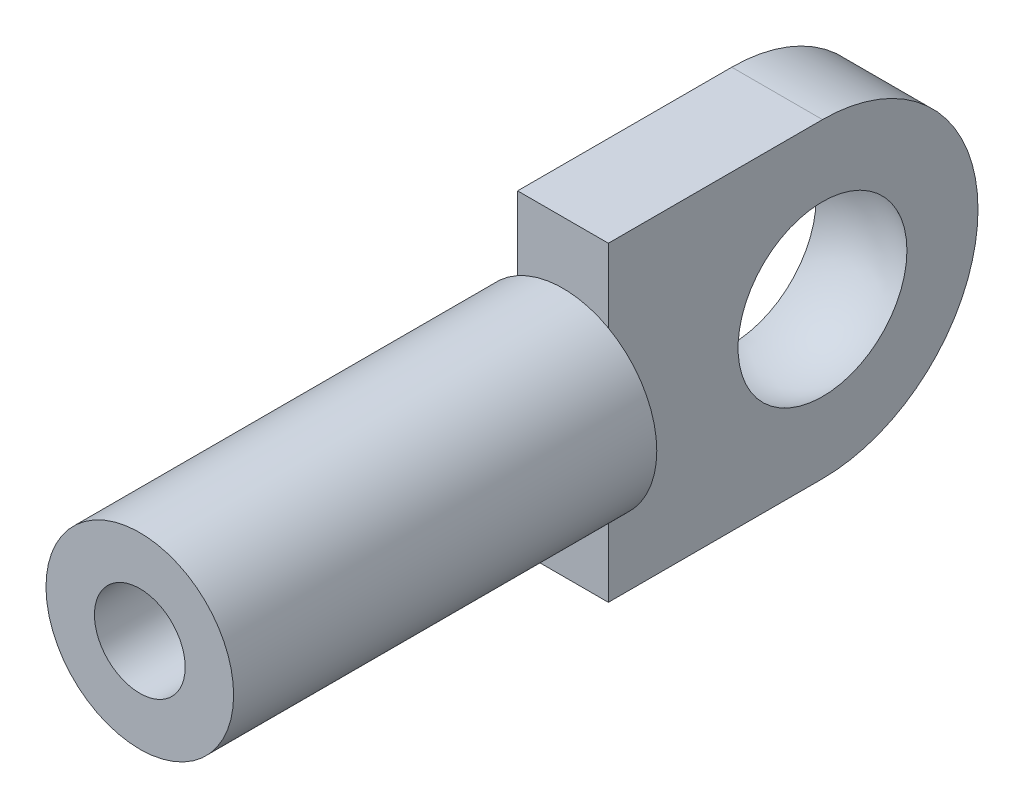
ISO-10303-21;
HEADER;
FILE_DESCRIPTION(('STEP AP214'),'2;1');
FILE_NAME('part.step','',(''),(''),'','','');
FILE_SCHEMA(('AUTOMOTIVE_DESIGN { 1 0 10303 214 1 1 1 1 }'));
ENDSEC;
DATA;
#1=APPLICATION_CONTEXT('core data for automotive mechanical design processes');
#2=APPLICATION_PROTOCOL_DEFINITION('international standard','automotive_design',2000,#1);
#3=PRODUCT_CONTEXT('',#1,'mechanical');
#4=PRODUCT('Part','Part','',(#3));
#5=PRODUCT_RELATED_PRODUCT_CATEGORY('part','',(#4));
#6=PRODUCT_DEFINITION_FORMATION('','',#4);
#7=PRODUCT_DEFINITION_CONTEXT('part definition',#1,'design');
#8=PRODUCT_DEFINITION('design','',#6,#7);
#9=PRODUCT_DEFINITION_SHAPE('','',#8);
#10=(LENGTH_UNIT() NAMED_UNIT(*) SI_UNIT(.MILLI.,.METRE.));
#11=(NAMED_UNIT(*) PLANE_ANGLE_UNIT() SI_UNIT($,.RADIAN.));
#12=(NAMED_UNIT(*) SI_UNIT($,.STERADIAN.) SOLID_ANGLE_UNIT());
#13=UNCERTAINTY_MEASURE_WITH_UNIT(LENGTH_MEASURE(1.E-05),#10,'distance_accuracy_value','');
#14=(GEOMETRIC_REPRESENTATION_CONTEXT(3) GLOBAL_UNCERTAINTY_ASSIGNED_CONTEXT((#13)) GLOBAL_UNIT_ASSIGNED_CONTEXT((#10,
#11,#12)) REPRESENTATION_CONTEXT('',''));
#15=CARTESIAN_POINT('',(0.,0.,0.));
#16=DIRECTION('',(0.,0.,1.));
#17=DIRECTION('',(1.,0.,0.));
#18=AXIS2_PLACEMENT_3D('',#15,#16,#17);
#19=CARTESIAN_POINT('',(0.,0.,0.));
#20=DIRECTION('',(0.,0.,1.));
#21=DIRECTION('',(1.,0.,0.));
#22=AXIS2_PLACEMENT_3D('',#19,#20,#21);
#23=PLANE('',#22);
#24=DIRECTION('',(0.,-1.,0.));
#25=VECTOR('',#24,1.);
#26=CARTESIAN_POINT('',(1.1303,0.,0.));
#27=LINE('',#26,#25);
#28=CARTESIAN_POINT('',(1.1303,2.04525209937553,0.));
#29=VERTEX_POINT('',#28);
#30=CARTESIAN_POINT('',(1.1303,-2.04525209937553,0.));
#31=VERTEX_POINT('',#30);
#32=EDGE_CURVE('E11',#29,#31,#27,.T.);
#33=ORIENTED_EDGE('',*,*,#32,.F.);
#34=CARTESIAN_POINT('',(0.,0.,0.));
#35=DIRECTION('',(0.,0.,1.));
#36=DIRECTION('',(1.,0.,0.));
#37=AXIS2_PLACEMENT_3D('',#34,#35,#36);
#38=CIRCLE('',#37,2.3368);
#39=EDGE_CURVE('E158',#31,#29,#38,.T.);
#40=ORIENTED_EDGE('',*,*,#39,.F.);
#41=EDGE_LOOP('',(#33,#40));
#42=FACE_BOUND('',#41,.T.);
#43=ADVANCED_FACE('F40',(#42),#23,.F.);
#44=CARTESIAN_POINT('',(0.,0.,10.541));
#45=DIRECTION('',(0.,0.,-1.));
#46=DIRECTION('',(-1.,0.,0.));
#47=AXIS2_PLACEMENT_3D('',#44,#45,#46);
#48=CYLINDRICAL_SURFACE('',#47,2.3368);
#49=CARTESIAN_POINT('',(0.,0.,10.541));
#50=DIRECTION('',(0.,0.,1.));
#51=DIRECTION('',(1.,0.,0.));
#52=AXIS2_PLACEMENT_3D('',#49,#50,#51);
#53=CIRCLE('',#52,2.3368);
#54=CARTESIAN_POINT('',(2.3368,0.,10.541));
#55=VERTEX_POINT('',#54);
#56=EDGE_CURVE('E163',#55,#55,#53,.T.);
#57=ORIENTED_EDGE('',*,*,#56,.F.);
#58=EDGE_LOOP('',(#57));
#59=FACE_BOUND('',#58,.T.);
#60=CARTESIAN_POINT('',(-1.1303,2.04525209937553,0.));
#61=VERTEX_POINT('',#60);
#62=EDGE_CURVE('E165',#29,#61,#38,.T.);
#63=ORIENTED_EDGE('',*,*,#62,.T.);
#64=CARTESIAN_POINT('',(-1.1303,-2.04525209937553,0.));
#65=VERTEX_POINT('',#64);
#66=EDGE_CURVE('E168',#61,#65,#38,.T.);
#67=ORIENTED_EDGE('',*,*,#66,.T.);
#68=EDGE_CURVE('E174',#65,#31,#38,.T.);
#69=ORIENTED_EDGE('',*,*,#68,.T.);
#70=ORIENTED_EDGE('',*,*,#39,.T.);
#71=EDGE_LOOP('',(#63,#67,#69,#70));
#72=FACE_BOUND('',#71,.T.);
#73=ADVANCED_FACE('F42',(#59,#72),#48,.T.);
#74=CARTESIAN_POINT('',(0.,0.,10.541));
#75=DIRECTION('',(0.,0.,1.));
#76=DIRECTION('',(1.,0.,0.));
#77=AXIS2_PLACEMENT_3D('',#74,#75,#76);
#78=PLANE('',#77);
#79=CARTESIAN_POINT('',(0.,0.,10.541));
#80=DIRECTION('',(0.,0.,1.));
#81=DIRECTION('',(1.,0.,0.));
#82=AXIS2_PLACEMENT_3D('',#79,#80,#81);
#83=CIRCLE('',#82,1.1303);
#84=CARTESIAN_POINT('',(1.1303,0.,10.541));
#85=VERTEX_POINT('',#84);
#86=EDGE_CURVE('E332',#85,#85,#83,.T.);
#87=ORIENTED_EDGE('',*,*,#86,.F.);
#88=EDGE_LOOP('',(#87));
#89=FACE_BOUND('',#88,.T.);
#90=ORIENTED_EDGE('',*,*,#56,.T.);
#91=EDGE_LOOP('',(#90));
#92=FACE_BOUND('',#91,.T.);
#93=ADVANCED_FACE('F184',(#89,#92),#78,.T.);
#94=ORIENTED_EDGE('',*,*,#66,.F.);
#95=DIRECTION('',(0.,-1.,0.));
#96=VECTOR('',#95,1.);
#97=CARTESIAN_POINT('',(-1.1303,0.,0.));
#98=LINE('',#97,#96);
#99=EDGE_CURVE('E50',#61,#65,#98,.T.);
#100=ORIENTED_EDGE('',*,*,#99,.T.);
#101=EDGE_LOOP('',(#94,#100));
#102=FACE_BOUND('',#101,.T.);
#103=ADVANCED_FACE('F179',(#102),#23,.F.);
#104=CARTESIAN_POINT('',(-1.1303,0.,0.));
#105=DIRECTION('',(0.,0.,1.));
#106=DIRECTION('',(1.,0.,0.));
#107=AXIS2_PLACEMENT_3D('',#104,#105,#106);
#108=PLANE('',#107);
#109=ORIENTED_EDGE('',*,*,#62,.F.);
#110=CARTESIAN_POINT('',(1.1303,3.8735,0.));
#111=VERTEX_POINT('',#110);
#112=EDGE_CURVE('E52',#111,#29,#27,.T.);
#113=ORIENTED_EDGE('',*,*,#112,.F.);
#114=DIRECTION('',(1.,0.,0.));
#115=VECTOR('',#114,1.);
#116=CARTESIAN_POINT('',(-1.1303,3.8735,0.));
#117=LINE('',#116,#115);
#118=CARTESIAN_POINT('',(-1.1303,3.8735,0.));
#119=VERTEX_POINT('',#118);
#120=EDGE_CURVE('E155',#119,#111,#117,.T.);
#121=ORIENTED_EDGE('',*,*,#120,.F.);
#122=EDGE_CURVE('E143',#119,#61,#98,.T.);
#123=ORIENTED_EDGE('',*,*,#122,.T.);
#124=EDGE_LOOP('',(#109,#113,#121,#123));
#125=FACE_BOUND('',#124,.T.);
#126=ADVANCED_FACE('F183',(#125),#108,.T.);
#127=ORIENTED_EDGE('',*,*,#68,.F.);
#128=CARTESIAN_POINT('',(-1.1303,-3.8735,0.));
#129=VERTEX_POINT('',#128);
#130=EDGE_CURVE('E63',#65,#129,#98,.T.);
#131=ORIENTED_EDGE('',*,*,#130,.T.);
#132=DIRECTION('',(1.,0.,0.));
#133=VECTOR('',#132,1.);
#134=CARTESIAN_POINT('',(-1.1303,-3.8735,0.));
#135=LINE('',#134,#133);
#136=CARTESIAN_POINT('',(1.1303,-3.8735,0.));
#137=VERTEX_POINT('',#136);
#138=EDGE_CURVE('E120',#129,#137,#135,.T.);
#139=ORIENTED_EDGE('',*,*,#138,.T.);
#140=EDGE_CURVE('E53',#31,#137,#27,.T.);
#141=ORIENTED_EDGE('',*,*,#140,.F.);
#142=EDGE_LOOP('',(#127,#131,#139,#141));
#143=FACE_BOUND('',#142,.T.);
#144=ADVANCED_FACE('F121',(#143),#108,.T.);
#145=CARTESIAN_POINT('',(-1.1303,3.8735,-5.334));
#146=DIRECTION('',(0.,1.,0.));
#147=DIRECTION('',(0.,0.,1.));
#148=AXIS2_PLACEMENT_3D('',#145,#146,#147);
#149=PLANE('',#148);
#150=ORIENTED_EDGE('',*,*,#120,.T.);
#151=DIRECTION('',(0.,0.,1.));
#152=VECTOR('',#151,1.);
#153=CARTESIAN_POINT('',(1.1303,3.8735,-5.334));
#154=LINE('',#153,#152);
#155=CARTESIAN_POINT('',(1.1303,3.8735,-5.334));
#156=VERTEX_POINT('',#155);
#157=EDGE_CURVE('E135',#156,#111,#154,.T.);
#158=ORIENTED_EDGE('',*,*,#157,.F.);
#159=DIRECTION('',(1.,0.,0.));
#160=VECTOR('',#159,1.);
#161=CARTESIAN_POINT('',(-1.1303,3.8735,-5.334));
#162=LINE('',#161,#160);
#163=CARTESIAN_POINT('',(-1.1303,3.8735,-5.334));
#164=VERTEX_POINT('',#163);
#165=EDGE_CURVE('E159',#164,#156,#162,.T.);
#166=ORIENTED_EDGE('',*,*,#165,.F.);
#167=DIRECTION('',(0.,0.,1.));
#168=VECTOR('',#167,1.);
#169=CARTESIAN_POINT('',(-1.1303,3.8735,-5.334));
#170=LINE('',#169,#168);
#171=EDGE_CURVE('E126',#164,#119,#170,.T.);
#172=ORIENTED_EDGE('',*,*,#171,.T.);
#173=EDGE_LOOP('',(#150,#158,#166,#172));
#174=FACE_BOUND('',#173,.T.);
#175=ADVANCED_FACE('F250',(#174),#149,.T.);
#176=CARTESIAN_POINT('',(-1.1303,0.,-5.334));
#177=DIRECTION('',(1.,0.,0.));
#178=DIRECTION('',(0.,0.,-1.));
#179=AXIS2_PLACEMENT_3D('',#176,#177,#178);
#180=CYLINDRICAL_SURFACE('',#179,3.8735);
#181=ORIENTED_EDGE('',*,*,#165,.T.);
#182=CARTESIAN_POINT('',(1.1303,0.,-5.334));
#183=DIRECTION('',(1.,0.,0.));
#184=DIRECTION('',(0.,0.,-1.));
#185=AXIS2_PLACEMENT_3D('',#182,#183,#184);
#186=CIRCLE('',#185,3.8735);
#187=CARTESIAN_POINT('',(1.1303,-3.8735,-5.334));
#188=VERTEX_POINT('',#187);
#189=EDGE_CURVE('E130',#188,#156,#186,.T.);
#190=ORIENTED_EDGE('',*,*,#189,.F.);
#191=DIRECTION('',(1.,0.,0.));
#192=VECTOR('',#191,1.);
#193=CARTESIAN_POINT('',(-1.1303,-3.8735,-5.334));
#194=LINE('',#193,#192);
#195=CARTESIAN_POINT('',(-1.1303,-3.8735,-5.334));
#196=VERTEX_POINT('',#195);
#197=EDGE_CURVE('E125',#196,#188,#194,.T.);
#198=ORIENTED_EDGE('',*,*,#197,.F.);
#199=CARTESIAN_POINT('',(-1.1303,0.,-5.334));
#200=DIRECTION('',(1.,0.,0.));
#201=DIRECTION('',(0.,0.,-1.));
#202=AXIS2_PLACEMENT_3D('',#199,#200,#201);
#203=CIRCLE('',#202,3.8735);
#204=EDGE_CURVE('E148',#196,#164,#203,.T.);
#205=ORIENTED_EDGE('',*,*,#204,.T.);
#206=EDGE_LOOP('',(#181,#190,#198,#205));
#207=FACE_BOUND('',#206,.T.);
#208=ADVANCED_FACE('F253',(#207),#180,.T.);
#209=CARTESIAN_POINT('',(-1.1303,-3.8735,-5.334));
#210=DIRECTION('',(0.,-1.,0.));
#211=DIRECTION('',(0.,0.,-1.));
#212=AXIS2_PLACEMENT_3D('',#209,#210,#211);
#213=PLANE('',#212);
#214=ORIENTED_EDGE('',*,*,#197,.T.);
#215=DIRECTION('',(0.,0.,-1.));
#216=VECTOR('',#215,1.);
#217=CARTESIAN_POINT('',(1.1303,-3.8735,-5.334));
#218=LINE('',#217,#216);
#219=EDGE_CURVE('E112',#137,#188,#218,.T.);
#220=ORIENTED_EDGE('',*,*,#219,.F.);
#221=ORIENTED_EDGE('',*,*,#138,.F.);
#222=DIRECTION('',(0.,0.,-1.));
#223=VECTOR('',#222,1.);
#224=CARTESIAN_POINT('',(-1.1303,-3.8735,-5.334));
#225=LINE('',#224,#223);
#226=EDGE_CURVE('E145',#129,#196,#225,.T.);
#227=ORIENTED_EDGE('',*,*,#226,.T.);
#228=EDGE_LOOP('',(#214,#220,#221,#227));
#229=FACE_BOUND('',#228,.T.);
#230=ADVANCED_FACE('F128',(#229),#213,.T.);
#231=CARTESIAN_POINT('',(-1.1303,0.,-5.334));
#232=DIRECTION('',(1.,0.,0.));
#233=DIRECTION('',(0.,0.,-1.));
#234=AXIS2_PLACEMENT_3D('',#231,#232,#233);
#235=PLANE('',#234);
#236=CARTESIAN_POINT('',(-1.1303,0.,-5.334));
#237=DIRECTION('',(1.,0.,0.));
#238=DIRECTION('',(0.,0.,-1.));
#239=AXIS2_PLACEMENT_3D('',#236,#237,#238);
#240=CIRCLE('',#239,2.10310619560687);
#241=CARTESIAN_POINT('',(-1.1303,0.,-7.43710619560687));
#242=VERTEX_POINT('',#241);
#243=EDGE_CURVE('E118',#242,#242,#240,.T.);
#244=ORIENTED_EDGE('',*,*,#243,.T.);
#245=EDGE_LOOP('',(#244));
#246=FACE_BOUND('',#245,.T.);
#247=ORIENTED_EDGE('',*,*,#122,.F.);
#248=ORIENTED_EDGE('',*,*,#171,.F.);
#249=ORIENTED_EDGE('',*,*,#204,.F.);
#250=ORIENTED_EDGE('',*,*,#226,.F.);
#251=ORIENTED_EDGE('',*,*,#130,.F.);
#252=ORIENTED_EDGE('',*,*,#99,.F.);
#253=EDGE_LOOP('',(#247,#248,#249,#250,#251,#252));
#254=FACE_BOUND('',#253,.T.);
#255=ADVANCED_FACE('F245',(#246,#254),#235,.F.);
#256=CARTESIAN_POINT('',(1.1303,0.,-5.334));
#257=DIRECTION('',(1.,0.,0.));
#258=DIRECTION('',(0.,0.,-1.));
#259=AXIS2_PLACEMENT_3D('',#256,#257,#258);
#260=PLANE('',#259);
#261=CARTESIAN_POINT('',(1.1303,0.,-5.334));
#262=DIRECTION('',(1.,0.,0.));
#263=DIRECTION('',(0.,0.,-1.));
#264=AXIS2_PLACEMENT_3D('',#261,#262,#263);
#265=CIRCLE('',#264,2.10310619560687);
#266=CARTESIAN_POINT('',(1.1303,0.,-7.43710619560687));
#267=VERTEX_POINT('',#266);
#268=EDGE_CURVE('E44',#267,#267,#265,.T.);
#269=ORIENTED_EDGE('',*,*,#268,.F.);
#270=EDGE_LOOP('',(#269));
#271=FACE_BOUND('',#270,.T.);
#272=ORIENTED_EDGE('',*,*,#112,.T.);
#273=ORIENTED_EDGE('',*,*,#32,.T.);
#274=ORIENTED_EDGE('',*,*,#140,.T.);
#275=ORIENTED_EDGE('',*,*,#219,.T.);
#276=ORIENTED_EDGE('',*,*,#189,.T.);
#277=ORIENTED_EDGE('',*,*,#157,.T.);
#278=EDGE_LOOP('',(#272,#273,#274,#275,#276,#277));
#279=FACE_BOUND('',#278,.T.);
#280=ADVANCED_FACE('F109',(#271,#279),#260,.T.);
#281=CARTESIAN_POINT('',(0.,0.,-5.334));
#282=DIRECTION('',(0.,1.,0.));
#283=DIRECTION('',(0.,0.,-1.));
#284=AXIS2_PLACEMENT_3D('',#281,#282,#283);
#285=SPHERICAL_SURFACE('',#284,2.3876);
#286=CARTESIAN_POINT('',(0.,0.,-5.334));
#287=DIRECTION('',(1.,0.,0.));
#288=DIRECTION('',(0.,0.,-1.));
#289=AXIS2_PLACEMENT_3D('',#286,#287,#288);
#290=SPHERICAL_SURFACE('',#289,2.3876);
#291=ORIENTED_EDGE('',*,*,#268,.T.);
#292=EDGE_LOOP('',(#291));
#293=FACE_BOUND('',#292,.T.);
#294=ORIENTED_EDGE('',*,*,#243,.F.);
#295=EDGE_LOOP('',(#294));
#296=FACE_BOUND('',#295,.T.);
#297=ADVANCED_FACE('F214',(#293,#296),#290,.F.);
#298=CARTESIAN_POINT('',(0.,0.,2.54));
#299=DIRECTION('',(0.,0.,1.));
#300=DIRECTION('',(1.,0.,0.));
#301=AXIS2_PLACEMENT_3D('',#298,#299,#300);
#302=CYLINDRICAL_SURFACE('',#301,1.1303);
#303=CARTESIAN_POINT('',(0.,0.,2.54));
#304=DIRECTION('',(0.,0.,1.));
#305=DIRECTION('',(1.,0.,0.));
#306=AXIS2_PLACEMENT_3D('',#303,#304,#305);
#307=CIRCLE('',#306,1.1303);
#308=CARTESIAN_POINT('',(1.1303,0.,2.54));
#309=VERTEX_POINT('',#308);
#310=EDGE_CURVE('E330',#309,#309,#307,.T.);
#311=ORIENTED_EDGE('',*,*,#310,.F.);
#312=EDGE_LOOP('',(#311));
#313=FACE_BOUND('',#312,.T.);
#314=ORIENTED_EDGE('',*,*,#86,.T.);
#315=EDGE_LOOP('',(#314));
#316=FACE_BOUND('',#315,.T.);
#317=ADVANCED_FACE('F219',(#313,#316),#302,.F.);
#318=CARTESIAN_POINT('',(0.,0.,2.54));
#319=DIRECTION('',(0.,0.,1.));
#320=DIRECTION('',(1.,0.,0.));
#321=AXIS2_PLACEMENT_3D('',#318,#319,#320);
#322=PLANE('',#321);
#323=ORIENTED_EDGE('',*,*,#310,.T.);
#324=EDGE_LOOP('',(#323));
#325=FACE_BOUND('',#324,.T.);
#326=ADVANCED_FACE('F224',(#325),#322,.T.);
#327=CLOSED_SHELL('',(#43,#73,#93,#103,#126,#144,#175,#208,#230,#255,#280,#297,#317,#326));
#328=MANIFOLD_SOLID_BREP('B2',#327);
#329=ADVANCED_BREP_SHAPE_REPRESENTATION('',(#18,#328),#14);
#330=SHAPE_DEFINITION_REPRESENTATION(#9,#329);
ENDSEC;
END-ISO-10303-21;
